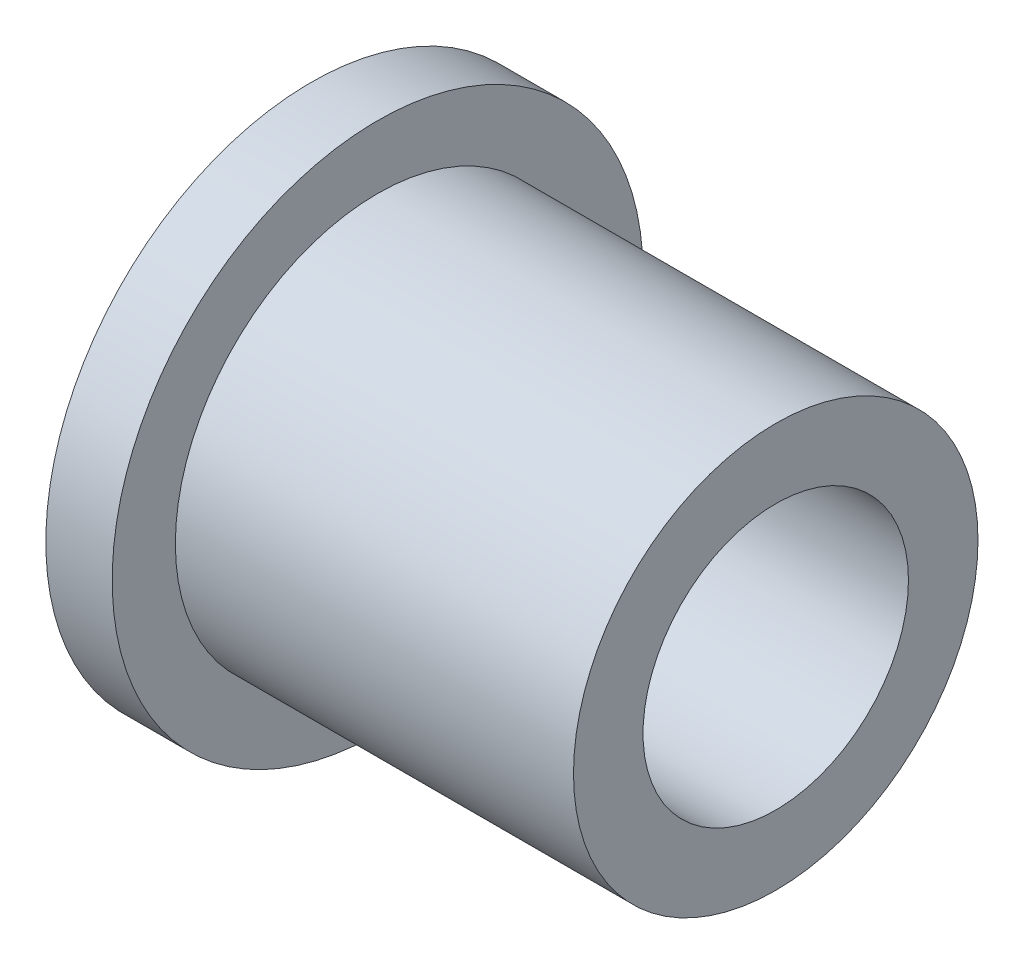
ISO-10303-21;
HEADER;
FILE_DESCRIPTION(('STEP AP214'),'2;1');
FILE_NAME('part.step','',(''),(''),'','','');
FILE_SCHEMA(('AUTOMOTIVE_DESIGN { 1 0 10303 214 1 1 1 1 }'));
ENDSEC;
DATA;
#1=APPLICATION_CONTEXT('core data for automotive mechanical design processes');
#2=APPLICATION_PROTOCOL_DEFINITION('international standard','automotive_design',2000,#1);
#3=PRODUCT_CONTEXT('',#1,'mechanical');
#4=PRODUCT('Part','Part','',(#3));
#5=PRODUCT_RELATED_PRODUCT_CATEGORY('part','',(#4));
#6=PRODUCT_DEFINITION_FORMATION('','',#4);
#7=PRODUCT_DEFINITION_CONTEXT('part definition',#1,'design');
#8=PRODUCT_DEFINITION('design','',#6,#7);
#9=PRODUCT_DEFINITION_SHAPE('','',#8);
#10=(LENGTH_UNIT() NAMED_UNIT(*) SI_UNIT(.MILLI.,.METRE.));
#11=(NAMED_UNIT(*) PLANE_ANGLE_UNIT() SI_UNIT($,.RADIAN.));
#12=(NAMED_UNIT(*) SI_UNIT($,.STERADIAN.) SOLID_ANGLE_UNIT());
#13=UNCERTAINTY_MEASURE_WITH_UNIT(LENGTH_MEASURE(1.E-05),#10,'distance_accuracy_value','');
#14=(GEOMETRIC_REPRESENTATION_CONTEXT(3) GLOBAL_UNCERTAINTY_ASSIGNED_CONTEXT((#13)) GLOBAL_UNIT_ASSIGNED_CONTEXT((#10,
#11,#12)) REPRESENTATION_CONTEXT('',''));
#15=CARTESIAN_POINT('',(0.,0.,0.));
#16=DIRECTION('',(0.,0.,1.));
#17=DIRECTION('',(1.,0.,0.));
#18=AXIS2_PLACEMENT_3D('',#15,#16,#17);
#19=CARTESIAN_POINT('',(1.5875,0.,0.));
#20=DIRECTION('',(1.,0.,0.));
#21=DIRECTION('',(0.,0.,-1.));
#22=AXIS2_PLACEMENT_3D('',#19,#20,#21);
#23=PLANE('',#22);
#24=CARTESIAN_POINT('',(1.5875,0.,0.));
#25=DIRECTION('',(1.,0.,0.));
#26=DIRECTION('',(0.,0.,-1.));
#27=AXIS2_PLACEMENT_3D('',#24,#25,#26);
#28=CIRCLE('',#27,6.35);
#29=CARTESIAN_POINT('',(1.5875,0.,-6.35));
#30=VERTEX_POINT('',#29);
#31=EDGE_CURVE('E10',#30,#30,#28,.T.);
#32=ORIENTED_EDGE('',*,*,#31,.T.);
#33=EDGE_LOOP('',(#32));
#34=FACE_BOUND('',#33,.T.);
#35=CARTESIAN_POINT('',(1.5875,0.,0.));
#36=DIRECTION('',(1.,0.,0.));
#37=DIRECTION('',(0.,0.,-1.));
#38=AXIS2_PLACEMENT_3D('',#35,#36,#37);
#39=CIRCLE('',#38,4.8387);
#40=CARTESIAN_POINT('',(1.5875,0.,-4.8387));
#41=VERTEX_POINT('',#40);
#42=EDGE_CURVE('E47',#41,#41,#39,.T.);
#43=ORIENTED_EDGE('',*,*,#42,.F.);
#44=EDGE_LOOP('',(#43));
#45=FACE_BOUND('',#44,.T.);
#46=ADVANCED_FACE('F31',(#34,#45),#23,.T.);
#47=CARTESIAN_POINT('',(0.,0.,0.));
#48=DIRECTION('',(1.,0.,0.));
#49=DIRECTION('',(0.,0.,-1.));
#50=AXIS2_PLACEMENT_3D('',#47,#48,#49);
#51=PLANE('',#50);
#52=CARTESIAN_POINT('',(0.,0.,0.));
#53=DIRECTION('',(1.,0.,0.));
#54=DIRECTION('',(0.,0.,-1.));
#55=AXIS2_PLACEMENT_3D('',#52,#53,#54);
#56=CIRCLE('',#55,6.35);
#57=CARTESIAN_POINT('',(0.,0.,-6.35));
#58=VERTEX_POINT('',#57);
#59=EDGE_CURVE('E35',#58,#58,#56,.T.);
#60=ORIENTED_EDGE('',*,*,#59,.F.);
#61=EDGE_LOOP('',(#60));
#62=FACE_BOUND('',#61,.T.);
#63=CARTESIAN_POINT('',(0.,0.,0.));
#64=DIRECTION('',(1.,0.,0.));
#65=DIRECTION('',(0.,0.,-1.));
#66=AXIS2_PLACEMENT_3D('',#63,#64,#65);
#67=CIRCLE('',#66,3.175);
#68=CARTESIAN_POINT('',(0.,0.,-3.175));
#69=VERTEX_POINT('',#68);
#70=EDGE_CURVE('E42',#69,#69,#67,.T.);
#71=ORIENTED_EDGE('',*,*,#70,.T.);
#72=EDGE_LOOP('',(#71));
#73=FACE_BOUND('',#72,.T.);
#74=ADVANCED_FACE('F72',(#62,#73),#51,.F.);
#75=CARTESIAN_POINT('',(1.5875,0.,0.));
#76=DIRECTION('',(-1.,0.,0.));
#77=DIRECTION('',(0.,0.,1.));
#78=AXIS2_PLACEMENT_3D('',#75,#76,#77);
#79=CYLINDRICAL_SURFACE('',#78,6.35);
#80=ORIENTED_EDGE('',*,*,#31,.F.);
#81=EDGE_LOOP('',(#80));
#82=FACE_BOUND('',#81,.T.);
#83=ORIENTED_EDGE('',*,*,#59,.T.);
#84=EDGE_LOOP('',(#83));
#85=FACE_BOUND('',#84,.T.);
#86=ADVANCED_FACE('F33',(#82,#85),#79,.T.);
#87=CARTESIAN_POINT('',(1.5875,0.,0.));
#88=DIRECTION('',(-1.,0.,0.));
#89=DIRECTION('',(0.,0.,1.));
#90=AXIS2_PLACEMENT_3D('',#87,#88,#89);
#91=CYLINDRICAL_SURFACE('',#90,3.175);
#92=ORIENTED_EDGE('',*,*,#70,.F.);
#93=EDGE_LOOP('',(#92));
#94=FACE_BOUND('',#93,.T.);
#95=CARTESIAN_POINT('',(11.1125,0.,0.));
#96=DIRECTION('',(1.,0.,0.));
#97=DIRECTION('',(0.,0.,-1.));
#98=AXIS2_PLACEMENT_3D('',#95,#96,#97);
#99=CIRCLE('',#98,3.175);
#100=CARTESIAN_POINT('',(11.1125,0.,-3.175));
#101=VERTEX_POINT('',#100);
#102=EDGE_CURVE('E50',#101,#101,#99,.T.);
#103=ORIENTED_EDGE('',*,*,#102,.T.);
#104=EDGE_LOOP('',(#103));
#105=FACE_BOUND('',#104,.T.);
#106=ADVANCED_FACE('F56',(#94,#105),#91,.F.);
#107=CARTESIAN_POINT('',(11.1125,0.,0.));
#108=DIRECTION('',(1.,0.,0.));
#109=DIRECTION('',(0.,0.,-1.));
#110=AXIS2_PLACEMENT_3D('',#107,#108,#109);
#111=PLANE('',#110);
#112=CARTESIAN_POINT('',(11.1125,0.,0.));
#113=DIRECTION('',(1.,0.,0.));
#114=DIRECTION('',(0.,0.,-1.));
#115=AXIS2_PLACEMENT_3D('',#112,#113,#114);
#116=CIRCLE('',#115,4.8387);
#117=CARTESIAN_POINT('',(11.1125,0.,-4.8387));
#118=VERTEX_POINT('',#117);
#119=EDGE_CURVE('E46',#118,#118,#116,.T.);
#120=ORIENTED_EDGE('',*,*,#119,.T.);
#121=EDGE_LOOP('',(#120));
#122=FACE_BOUND('',#121,.T.);
#123=ORIENTED_EDGE('',*,*,#102,.F.);
#124=EDGE_LOOP('',(#123));
#125=FACE_BOUND('',#124,.T.);
#126=ADVANCED_FACE('F58',(#122,#125),#111,.T.);
#127=CARTESIAN_POINT('',(11.1125,0.,0.));
#128=DIRECTION('',(-1.,0.,0.));
#129=DIRECTION('',(0.,0.,1.));
#130=AXIS2_PLACEMENT_3D('',#127,#128,#129);
#131=CYLINDRICAL_SURFACE('',#130,4.8387);
#132=ORIENTED_EDGE('',*,*,#119,.F.);
#133=EDGE_LOOP('',(#132));
#134=FACE_BOUND('',#133,.T.);
#135=ORIENTED_EDGE('',*,*,#42,.T.);
#136=EDGE_LOOP('',(#135));
#137=FACE_BOUND('',#136,.T.);
#138=ADVANCED_FACE('F60',(#134,#137),#131,.T.);
#139=CLOSED_SHELL('',(#46,#74,#86,#106,#126,#138));
#140=MANIFOLD_SOLID_BREP('B2',#139);
#141=ADVANCED_BREP_SHAPE_REPRESENTATION('',(#18,#140),#14);
#142=SHAPE_DEFINITION_REPRESENTATION(#9,#141);
ENDSEC;
END-ISO-10303-21;
